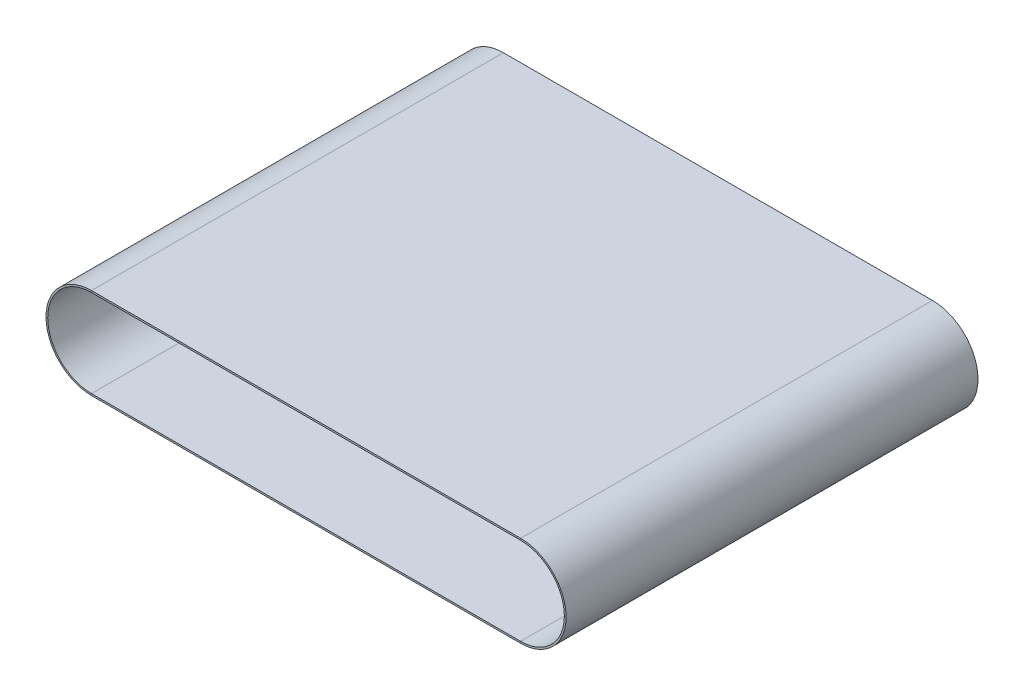
ISO-10303-21;
HEADER;
FILE_DESCRIPTION(('STEP AP214'),'2;1');
FILE_NAME('part.step','',(''),(''),'','','');
FILE_SCHEMA(('AUTOMOTIVE_DESIGN { 1 0 10303 214 1 1 1 1 }'));
ENDSEC;
DATA;
#1=APPLICATION_CONTEXT('core data for automotive mechanical design processes');
#2=APPLICATION_PROTOCOL_DEFINITION('international standard','automotive_design',2000,#1);
#3=PRODUCT_CONTEXT('',#1,'mechanical');
#4=PRODUCT('Part','Part','',(#3));
#5=PRODUCT_RELATED_PRODUCT_CATEGORY('part','',(#4));
#6=PRODUCT_DEFINITION_FORMATION('','',#4);
#7=PRODUCT_DEFINITION_CONTEXT('part definition',#1,'design');
#8=PRODUCT_DEFINITION('design','',#6,#7);
#9=PRODUCT_DEFINITION_SHAPE('','',#8);
#10=(LENGTH_UNIT() NAMED_UNIT(*) SI_UNIT(.MILLI.,.METRE.));
#11=(NAMED_UNIT(*) PLANE_ANGLE_UNIT() SI_UNIT($,.RADIAN.));
#12=(NAMED_UNIT(*) SI_UNIT($,.STERADIAN.) SOLID_ANGLE_UNIT());
#13=UNCERTAINTY_MEASURE_WITH_UNIT(LENGTH_MEASURE(1.E-05),#10,'distance_accuracy_value','');
#14=(GEOMETRIC_REPRESENTATION_CONTEXT(3) GLOBAL_UNCERTAINTY_ASSIGNED_CONTEXT((#13)) GLOBAL_UNIT_ASSIGNED_CONTEXT((#10,
#11,#12)) REPRESENTATION_CONTEXT('',''));
#15=CARTESIAN_POINT('',(0.,0.,0.));
#16=DIRECTION('',(0.,0.,1.));
#17=DIRECTION('',(1.,0.,0.));
#18=AXIS2_PLACEMENT_3D('',#15,#16,#17);
#19=CARTESIAN_POINT('',(-250.,25.5,120.));
#20=DIRECTION('',(0.,-1.,0.));
#21=DIRECTION('',(0.,0.,-1.));
#22=AXIS2_PLACEMENT_3D('',#19,#20,#21);
#23=PLANE('',#22);
#24=DIRECTION('',(1.,0.,0.));
#25=VECTOR('',#24,1.);
#26=CARTESIAN_POINT('',(-250.,25.5,120.));
#27=LINE('',#26,#25);
#28=CARTESIAN_POINT('',(-250.,25.5,120.));
#29=VERTEX_POINT('',#28);
#30=CARTESIAN_POINT('',(0.,25.5,120.));
#31=VERTEX_POINT('',#30);
#32=EDGE_CURVE('E11',#29,#31,#27,.T.);
#33=ORIENTED_EDGE('',*,*,#32,.F.);
#34=DIRECTION('',(0.,0.,-1.));
#35=VECTOR('',#34,1.);
#36=CARTESIAN_POINT('',(-250.,25.5,120.));
#37=LINE('',#36,#35);
#38=CARTESIAN_POINT('',(-250.,25.5,-120.));
#39=VERTEX_POINT('',#38);
#40=EDGE_CURVE('E42',#29,#39,#37,.T.);
#41=ORIENTED_EDGE('',*,*,#40,.T.);
#42=DIRECTION('',(1.,0.,0.));
#43=VECTOR('',#42,1.);
#44=CARTESIAN_POINT('',(-250.,25.5,-120.));
#45=LINE('',#44,#43);
#46=CARTESIAN_POINT('',(0.,25.5,-120.));
#47=VERTEX_POINT('',#46);
#48=EDGE_CURVE('E127',#39,#47,#45,.T.);
#49=ORIENTED_EDGE('',*,*,#48,.T.);
#50=DIRECTION('',(0.,0.,-1.));
#51=VECTOR('',#50,1.);
#52=CARTESIAN_POINT('',(0.,25.5,120.));
#53=LINE('',#52,#51);
#54=EDGE_CURVE('E130',#31,#47,#53,.T.);
#55=ORIENTED_EDGE('',*,*,#54,.F.);
#56=EDGE_LOOP('',(#33,#41,#49,#55));
#57=FACE_BOUND('',#56,.T.);
#58=ADVANCED_FACE('F39',(#57),#23,.T.);
#59=CARTESIAN_POINT('',(-250.,25.5,120.));
#60=DIRECTION('',(0.,0.,1.));
#61=DIRECTION('',(1.,0.,0.));
#62=AXIS2_PLACEMENT_3D('',#59,#60,#61);
#63=PLANE('',#62);
#64=DIRECTION('',(1.,0.,0.));
#65=VECTOR('',#64,1.);
#66=CARTESIAN_POINT('',(-250.,26.5,120.));
#67=LINE('',#66,#65);
#68=CARTESIAN_POINT('',(-250.,26.5,120.));
#69=VERTEX_POINT('',#68);
#70=CARTESIAN_POINT('',(0.,26.5,120.));
#71=VERTEX_POINT('',#70);
#72=EDGE_CURVE('E47',#69,#71,#67,.T.);
#73=ORIENTED_EDGE('',*,*,#72,.F.);
#74=DIRECTION('',(0.,-1.,0.));
#75=VECTOR('',#74,1.);
#76=CARTESIAN_POINT('',(-250.,25.5,120.));
#77=LINE('',#76,#75);
#78=EDGE_CURVE('E197',#69,#29,#77,.T.);
#79=ORIENTED_EDGE('',*,*,#78,.T.);
#80=ORIENTED_EDGE('',*,*,#32,.T.);
#81=DIRECTION('',(0.,-1.,0.));
#82=VECTOR('',#81,1.);
#83=CARTESIAN_POINT('',(0.,25.5,120.));
#84=LINE('',#83,#82);
#85=EDGE_CURVE('E155',#71,#31,#84,.T.);
#86=ORIENTED_EDGE('',*,*,#85,.F.);
#87=EDGE_LOOP('',(#73,#79,#80,#86));
#88=FACE_BOUND('',#87,.T.);
#89=ADVANCED_FACE('F221',(#88),#63,.T.);
#90=CARTESIAN_POINT('',(-250.,26.5,120.));
#91=DIRECTION('',(0.,1.,0.));
#92=DIRECTION('',(0.,0.,1.));
#93=AXIS2_PLACEMENT_3D('',#90,#91,#92);
#94=PLANE('',#93);
#95=DIRECTION('',(1.,0.,0.));
#96=VECTOR('',#95,1.);
#97=CARTESIAN_POINT('',(-250.,26.5,-120.));
#98=LINE('',#97,#96);
#99=CARTESIAN_POINT('',(-250.,26.5,-120.));
#100=VERTEX_POINT('',#99);
#101=CARTESIAN_POINT('',(0.,26.5,-120.));
#102=VERTEX_POINT('',#101);
#103=EDGE_CURVE('E136',#100,#102,#98,.T.);
#104=ORIENTED_EDGE('',*,*,#103,.F.);
#105=DIRECTION('',(0.,0.,1.));
#106=VECTOR('',#105,1.);
#107=CARTESIAN_POINT('',(-250.,26.5,120.));
#108=LINE('',#107,#106);
#109=EDGE_CURVE('E181',#100,#69,#108,.T.);
#110=ORIENTED_EDGE('',*,*,#109,.T.);
#111=ORIENTED_EDGE('',*,*,#72,.T.);
#112=DIRECTION('',(0.,0.,1.));
#113=VECTOR('',#112,1.);
#114=CARTESIAN_POINT('',(0.,26.5,120.));
#115=LINE('',#114,#113);
#116=EDGE_CURVE('E159',#102,#71,#115,.T.);
#117=ORIENTED_EDGE('',*,*,#116,.F.);
#118=EDGE_LOOP('',(#104,#110,#111,#117));
#119=FACE_BOUND('',#118,.T.);
#120=ADVANCED_FACE('F226',(#119),#94,.T.);
#121=CARTESIAN_POINT('',(-250.,0.,0.));
#122=DIRECTION('',(0.,0.,-1.));
#123=DIRECTION('',(-1.,0.,0.));
#124=AXIS2_PLACEMENT_3D('',#121,#122,#123);
#125=CYLINDRICAL_SURFACE('',#124,25.5);
#126=ORIENTED_EDGE('',*,*,#40,.F.);
#127=CARTESIAN_POINT('',(-250.,0.,120.));
#128=DIRECTION('',(0.,0.,-1.));
#129=DIRECTION('',(0.,-1.,0.));
#130=AXIS2_PLACEMENT_3D('',#127,#128,#129);
#131=CIRCLE('',#130,25.5);
#132=CARTESIAN_POINT('',(-250.,-25.5,120.));
#133=VERTEX_POINT('',#132);
#134=EDGE_CURVE('E83',#133,#29,#131,.T.);
#135=ORIENTED_EDGE('',*,*,#134,.F.);
#136=DIRECTION('',(0.,0.,-1.));
#137=VECTOR('',#136,1.);
#138=CARTESIAN_POINT('',(-250.,-25.5,120.));
#139=LINE('',#138,#137);
#140=CARTESIAN_POINT('',(-250.,-25.5,-120.));
#141=VERTEX_POINT('',#140);
#142=EDGE_CURVE('E184',#133,#141,#139,.T.);
#143=ORIENTED_EDGE('',*,*,#142,.T.);
#144=CARTESIAN_POINT('',(-250.,0.,-120.));
#145=DIRECTION('',(0.,0.,-1.));
#146=DIRECTION('',(0.,-1.,0.));
#147=AXIS2_PLACEMENT_3D('',#144,#145,#146);
#148=CIRCLE('',#147,25.5);
#149=EDGE_CURVE('E179',#141,#39,#148,.T.);
#150=ORIENTED_EDGE('',*,*,#149,.T.);
#151=EDGE_LOOP('',(#126,#135,#143,#150));
#152=FACE_BOUND('',#151,.T.);
#153=ADVANCED_FACE('F210',(#152),#125,.F.);
#154=CARTESIAN_POINT('',(-250.,-25.5,120.));
#155=DIRECTION('',(0.,0.,1.));
#156=DIRECTION('',(1.,0.,0.));
#157=AXIS2_PLACEMENT_3D('',#154,#155,#156);
#158=PLANE('',#157);
#159=ORIENTED_EDGE('',*,*,#134,.T.);
#160=ORIENTED_EDGE('',*,*,#78,.F.);
#161=CARTESIAN_POINT('',(-250.,0.,120.));
#162=DIRECTION('',(0.,0.,-1.));
#163=DIRECTION('',(0.,-1.,0.));
#164=AXIS2_PLACEMENT_3D('',#161,#162,#163);
#165=CIRCLE('',#164,26.5);
#166=CARTESIAN_POINT('',(-250.,-26.5,120.));
#167=VERTEX_POINT('',#166);
#168=EDGE_CURVE('E92',#167,#69,#165,.T.);
#169=ORIENTED_EDGE('',*,*,#168,.F.);
#170=DIRECTION('',(0.,1.,0.));
#171=VECTOR('',#170,1.);
#172=CARTESIAN_POINT('',(-250.,-25.5,120.));
#173=LINE('',#172,#171);
#174=EDGE_CURVE('E193',#167,#133,#173,.T.);
#175=ORIENTED_EDGE('',*,*,#174,.T.);
#176=EDGE_LOOP('',(#159,#160,#169,#175));
#177=FACE_BOUND('',#176,.T.);
#178=ADVANCED_FACE('F220',(#177),#158,.T.);
#179=CARTESIAN_POINT('',(-250.,0.,0.));
#180=DIRECTION('',(0.,0.,-1.));
#181=DIRECTION('',(-1.,0.,0.));
#182=AXIS2_PLACEMENT_3D('',#179,#180,#181);
#183=CYLINDRICAL_SURFACE('',#182,26.5);
#184=ORIENTED_EDGE('',*,*,#168,.T.);
#185=ORIENTED_EDGE('',*,*,#109,.F.);
#186=CARTESIAN_POINT('',(-250.,0.,-120.));
#187=DIRECTION('',(0.,0.,-1.));
#188=DIRECTION('',(0.,-1.,0.));
#189=AXIS2_PLACEMENT_3D('',#186,#187,#188);
#190=CIRCLE('',#189,26.5);
#191=CARTESIAN_POINT('',(-250.,-26.5,-120.));
#192=VERTEX_POINT('',#191);
#193=EDGE_CURVE('E100',#192,#100,#190,.T.);
#194=ORIENTED_EDGE('',*,*,#193,.F.);
#195=DIRECTION('',(0.,0.,1.));
#196=VECTOR('',#195,1.);
#197=CARTESIAN_POINT('',(-250.,-26.5,120.));
#198=LINE('',#197,#196);
#199=EDGE_CURVE('E173',#192,#167,#198,.T.);
#200=ORIENTED_EDGE('',*,*,#199,.T.);
#201=EDGE_LOOP('',(#184,#185,#194,#200));
#202=FACE_BOUND('',#201,.T.);
#203=ADVANCED_FACE('F227',(#202),#183,.T.);
#204=CARTESIAN_POINT('',(-250.,-25.5,-120.));
#205=DIRECTION('',(0.,0.,-1.));
#206=DIRECTION('',(-1.,0.,0.));
#207=AXIS2_PLACEMENT_3D('',#204,#205,#206);
#208=PLANE('',#207);
#209=ORIENTED_EDGE('',*,*,#193,.T.);
#210=DIRECTION('',(0.,1.,0.));
#211=VECTOR('',#210,1.);
#212=CARTESIAN_POINT('',(-250.,25.5,-120.));
#213=LINE('',#212,#211);
#214=EDGE_CURVE('E177',#39,#100,#213,.T.);
#215=ORIENTED_EDGE('',*,*,#214,.F.);
#216=ORIENTED_EDGE('',*,*,#149,.F.);
#217=DIRECTION('',(0.,-1.,0.));
#218=VECTOR('',#217,1.);
#219=CARTESIAN_POINT('',(-250.,-25.5,-120.));
#220=LINE('',#219,#218);
#221=EDGE_CURVE('E168',#141,#192,#220,.T.);
#222=ORIENTED_EDGE('',*,*,#221,.T.);
#223=EDGE_LOOP('',(#209,#215,#216,#222));
#224=FACE_BOUND('',#223,.T.);
#225=ADVANCED_FACE('F228',(#224),#208,.T.);
#226=CARTESIAN_POINT('',(0.,-25.5,120.));
#227=DIRECTION('',(0.,1.,0.));
#228=DIRECTION('',(0.,0.,1.));
#229=AXIS2_PLACEMENT_3D('',#226,#227,#228);
#230=PLANE('',#229);
#231=ORIENTED_EDGE('',*,*,#142,.F.);
#232=DIRECTION('',(-1.,0.,0.));
#233=VECTOR('',#232,1.);
#234=CARTESIAN_POINT('',(0.,-25.5,120.));
#235=LINE('',#234,#233);
#236=CARTESIAN_POINT('',(0.,-25.5,120.));
#237=VERTEX_POINT('',#236);
#238=EDGE_CURVE('E203',#237,#133,#235,.T.);
#239=ORIENTED_EDGE('',*,*,#238,.F.);
#240=DIRECTION('',(0.,0.,-1.));
#241=VECTOR('',#240,1.);
#242=CARTESIAN_POINT('',(0.,-25.5,120.));
#243=LINE('',#242,#241);
#244=CARTESIAN_POINT('',(0.,-25.5,-120.));
#245=VERTEX_POINT('',#244);
#246=EDGE_CURVE('E176',#237,#245,#243,.T.);
#247=ORIENTED_EDGE('',*,*,#246,.T.);
#248=DIRECTION('',(-1.,0.,0.));
#249=VECTOR('',#248,1.);
#250=CARTESIAN_POINT('',(0.,-25.5,-120.));
#251=LINE('',#250,#249);
#252=EDGE_CURVE('E171',#245,#141,#251,.T.);
#253=ORIENTED_EDGE('',*,*,#252,.T.);
#254=EDGE_LOOP('',(#231,#239,#247,#253));
#255=FACE_BOUND('',#254,.T.);
#256=ADVANCED_FACE('F215',(#255),#230,.T.);
#257=CARTESIAN_POINT('',(0.,-25.5,120.));
#258=DIRECTION('',(0.,0.,1.));
#259=DIRECTION('',(1.,0.,0.));
#260=AXIS2_PLACEMENT_3D('',#257,#258,#259);
#261=PLANE('',#260);
#262=ORIENTED_EDGE('',*,*,#238,.T.);
#263=ORIENTED_EDGE('',*,*,#174,.F.);
#264=DIRECTION('',(-1.,0.,0.));
#265=VECTOR('',#264,1.);
#266=CARTESIAN_POINT('',(0.,-26.5,120.));
#267=LINE('',#266,#265);
#268=CARTESIAN_POINT('',(0.,-26.5,120.));
#269=VERTEX_POINT('',#268);
#270=EDGE_CURVE('E112',#269,#167,#267,.T.);
#271=ORIENTED_EDGE('',*,*,#270,.F.);
#272=DIRECTION('',(0.,1.,0.));
#273=VECTOR('',#272,1.);
#274=CARTESIAN_POINT('',(0.,-25.5,120.));
#275=LINE('',#274,#273);
#276=EDGE_CURVE('E190',#269,#237,#275,.T.);
#277=ORIENTED_EDGE('',*,*,#276,.T.);
#278=EDGE_LOOP('',(#262,#263,#271,#277));
#279=FACE_BOUND('',#278,.T.);
#280=ADVANCED_FACE('F219',(#279),#261,.T.);
#281=CARTESIAN_POINT('',(0.,-26.5,120.));
#282=DIRECTION('',(0.,-1.,0.));
#283=DIRECTION('',(0.,0.,-1.));
#284=AXIS2_PLACEMENT_3D('',#281,#282,#283);
#285=PLANE('',#284);
#286=ORIENTED_EDGE('',*,*,#270,.T.);
#287=ORIENTED_EDGE('',*,*,#199,.F.);
#288=DIRECTION('',(-1.,0.,0.));
#289=VECTOR('',#288,1.);
#290=CARTESIAN_POINT('',(0.,-26.5,-120.));
#291=LINE('',#290,#289);
#292=CARTESIAN_POINT('',(0.,-26.5,-120.));
#293=VERTEX_POINT('',#292);
#294=EDGE_CURVE('E118',#293,#192,#291,.T.);
#295=ORIENTED_EDGE('',*,*,#294,.F.);
#296=DIRECTION('',(0.,0.,1.));
#297=VECTOR('',#296,1.);
#298=CARTESIAN_POINT('',(0.,-26.5,120.));
#299=LINE('',#298,#297);
#300=EDGE_CURVE('E166',#293,#269,#299,.T.);
#301=ORIENTED_EDGE('',*,*,#300,.T.);
#302=EDGE_LOOP('',(#286,#287,#295,#301));
#303=FACE_BOUND('',#302,.T.);
#304=ADVANCED_FACE('F284',(#303),#285,.T.);
#305=CARTESIAN_POINT('',(0.,-25.5,-120.));
#306=DIRECTION('',(0.,0.,-1.));
#307=DIRECTION('',(-1.,0.,0.));
#308=AXIS2_PLACEMENT_3D('',#305,#306,#307);
#309=PLANE('',#308);
#310=ORIENTED_EDGE('',*,*,#294,.T.);
#311=ORIENTED_EDGE('',*,*,#221,.F.);
#312=ORIENTED_EDGE('',*,*,#252,.F.);
#313=DIRECTION('',(0.,-1.,0.));
#314=VECTOR('',#313,1.);
#315=CARTESIAN_POINT('',(0.,-25.5,-120.));
#316=LINE('',#315,#314);
#317=EDGE_CURVE('E147',#245,#293,#316,.T.);
#318=ORIENTED_EDGE('',*,*,#317,.T.);
#319=EDGE_LOOP('',(#310,#311,#312,#318));
#320=FACE_BOUND('',#319,.T.);
#321=ADVANCED_FACE('F213',(#320),#309,.T.);
#322=CARTESIAN_POINT('',(0.,0.,0.));
#323=DIRECTION('',(0.,0.,-1.));
#324=DIRECTION('',(-1.,0.,0.));
#325=AXIS2_PLACEMENT_3D('',#322,#323,#324);
#326=CYLINDRICAL_SURFACE('',#325,25.5);
#327=ORIENTED_EDGE('',*,*,#246,.F.);
#328=CARTESIAN_POINT('',(0.,0.,120.));
#329=DIRECTION('',(0.,0.,-1.));
#330=DIRECTION('',(0.,1.,0.));
#331=AXIS2_PLACEMENT_3D('',#328,#329,#330);
#332=CIRCLE('',#331,25.5);
#333=EDGE_CURVE('E154',#31,#237,#332,.T.);
#334=ORIENTED_EDGE('',*,*,#333,.F.);
#335=ORIENTED_EDGE('',*,*,#54,.T.);
#336=CARTESIAN_POINT('',(0.,0.,-120.));
#337=DIRECTION('',(0.,0.,-1.));
#338=DIRECTION('',(0.,1.,0.));
#339=AXIS2_PLACEMENT_3D('',#336,#337,#338);
#340=CIRCLE('',#339,25.5);
#341=EDGE_CURVE('E142',#47,#245,#340,.T.);
#342=ORIENTED_EDGE('',*,*,#341,.T.);
#343=EDGE_LOOP('',(#327,#334,#335,#342));
#344=FACE_BOUND('',#343,.T.);
#345=ADVANCED_FACE('F152',(#344),#326,.F.);
#346=CARTESIAN_POINT('',(0.,25.5,120.));
#347=DIRECTION('',(0.,0.,1.));
#348=DIRECTION('',(1.,0.,0.));
#349=AXIS2_PLACEMENT_3D('',#346,#347,#348);
#350=PLANE('',#349);
#351=ORIENTED_EDGE('',*,*,#333,.T.);
#352=ORIENTED_EDGE('',*,*,#276,.F.);
#353=CARTESIAN_POINT('',(0.,0.,120.));
#354=DIRECTION('',(0.,0.,-1.));
#355=DIRECTION('',(0.,1.,0.));
#356=AXIS2_PLACEMENT_3D('',#353,#354,#355);
#357=CIRCLE('',#356,26.5);
#358=EDGE_CURVE('E187',#71,#269,#357,.T.);
#359=ORIENTED_EDGE('',*,*,#358,.F.);
#360=ORIENTED_EDGE('',*,*,#85,.T.);
#361=EDGE_LOOP('',(#351,#352,#359,#360));
#362=FACE_BOUND('',#361,.T.);
#363=ADVANCED_FACE('F217',(#362),#350,.T.);
#364=CARTESIAN_POINT('',(0.,0.,0.));
#365=DIRECTION('',(0.,0.,-1.));
#366=DIRECTION('',(-1.,0.,0.));
#367=AXIS2_PLACEMENT_3D('',#364,#365,#366);
#368=CYLINDRICAL_SURFACE('',#367,26.5);
#369=ORIENTED_EDGE('',*,*,#358,.T.);
#370=ORIENTED_EDGE('',*,*,#300,.F.);
#371=CARTESIAN_POINT('',(0.,0.,-120.));
#372=DIRECTION('',(0.,0.,-1.));
#373=DIRECTION('',(0.,1.,0.));
#374=AXIS2_PLACEMENT_3D('',#371,#372,#373);
#375=CIRCLE('',#374,26.5);
#376=EDGE_CURVE('E165',#102,#293,#375,.T.);
#377=ORIENTED_EDGE('',*,*,#376,.F.);
#378=ORIENTED_EDGE('',*,*,#116,.T.);
#379=EDGE_LOOP('',(#369,#370,#377,#378));
#380=FACE_BOUND('',#379,.T.);
#381=ADVANCED_FACE('F224',(#380),#368,.T.);
#382=CARTESIAN_POINT('',(0.,25.5,-120.));
#383=DIRECTION('',(0.,0.,-1.));
#384=DIRECTION('',(-1.,0.,0.));
#385=AXIS2_PLACEMENT_3D('',#382,#383,#384);
#386=PLANE('',#385);
#387=ORIENTED_EDGE('',*,*,#376,.T.);
#388=ORIENTED_EDGE('',*,*,#317,.F.);
#389=ORIENTED_EDGE('',*,*,#341,.F.);
#390=DIRECTION('',(0.,1.,0.));
#391=VECTOR('',#390,1.);
#392=CARTESIAN_POINT('',(0.,25.5,-120.));
#393=LINE('',#392,#391);
#394=EDGE_CURVE('E145',#47,#102,#393,.T.);
#395=ORIENTED_EDGE('',*,*,#394,.T.);
#396=EDGE_LOOP('',(#387,#388,#389,#395));
#397=FACE_BOUND('',#396,.T.);
#398=ADVANCED_FACE('F144',(#397),#386,.T.);
#399=CARTESIAN_POINT('',(-250.,25.5,-120.));
#400=DIRECTION('',(0.,0.,-1.));
#401=DIRECTION('',(-1.,0.,0.));
#402=AXIS2_PLACEMENT_3D('',#399,#400,#401);
#403=PLANE('',#402);
#404=ORIENTED_EDGE('',*,*,#214,.T.);
#405=ORIENTED_EDGE('',*,*,#103,.T.);
#406=ORIENTED_EDGE('',*,*,#394,.F.);
#407=ORIENTED_EDGE('',*,*,#48,.F.);
#408=EDGE_LOOP('',(#404,#405,#406,#407));
#409=FACE_BOUND('',#408,.T.);
#410=ADVANCED_FACE('F157',(#409),#403,.T.);
#411=CLOSED_SHELL('',(#58,#89,#120,#153,#178,#203,#225,#256,#280,#304,#321,#345,#363,#381,#398,#410));
#412=MANIFOLD_SOLID_BREP('B2',#411);
#413=ADVANCED_BREP_SHAPE_REPRESENTATION('',(#18,#412),#14);
#414=SHAPE_DEFINITION_REPRESENTATION(#9,#413);
ENDSEC;
END-ISO-10303-21;
